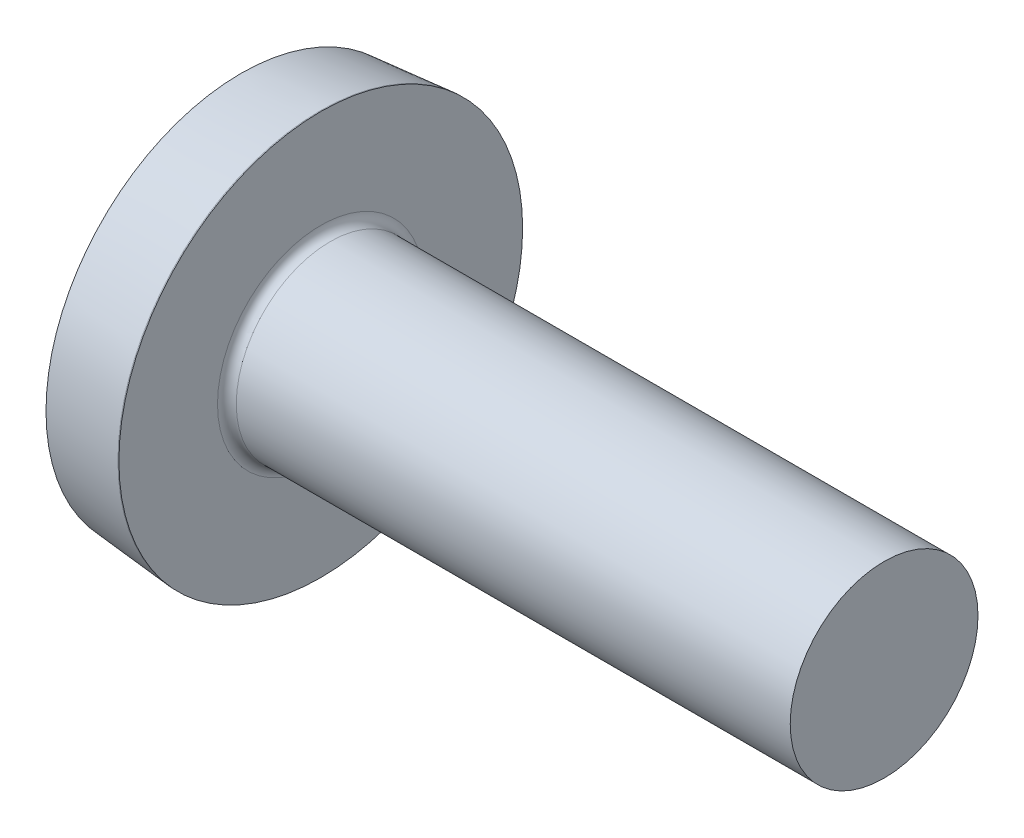
ISO-10303-21;
HEADER;
FILE_DESCRIPTION(('STEP AP214'),'2;1');
FILE_NAME('part.step','',(''),(''),'','','');
FILE_SCHEMA(('AUTOMOTIVE_DESIGN { 1 0 10303 214 1 1 1 1 }'));
ENDSEC;
DATA;
#1=APPLICATION_CONTEXT('core data for automotive mechanical design processes');
#2=APPLICATION_PROTOCOL_DEFINITION('international standard','automotive_design',2000,#1);
#3=PRODUCT_CONTEXT('',#1,'mechanical');
#4=PRODUCT('Part','Part','',(#3));
#5=PRODUCT_RELATED_PRODUCT_CATEGORY('part','',(#4));
#6=PRODUCT_DEFINITION_FORMATION('','',#4);
#7=PRODUCT_DEFINITION_CONTEXT('part definition',#1,'design');
#8=PRODUCT_DEFINITION('design','',#6,#7);
#9=PRODUCT_DEFINITION_SHAPE('','',#8);
#10=(LENGTH_UNIT() NAMED_UNIT(*) SI_UNIT(.MILLI.,.METRE.));
#11=(NAMED_UNIT(*) PLANE_ANGLE_UNIT() SI_UNIT($,.RADIAN.));
#12=(NAMED_UNIT(*) SI_UNIT($,.STERADIAN.) SOLID_ANGLE_UNIT());
#13=UNCERTAINTY_MEASURE_WITH_UNIT(LENGTH_MEASURE(1.E-05),#10,'distance_accuracy_value','');
#14=(GEOMETRIC_REPRESENTATION_CONTEXT(3) GLOBAL_UNCERTAINTY_ASSIGNED_CONTEXT((#13)) GLOBAL_UNIT_ASSIGNED_CONTEXT((#10,
#11,#12)) REPRESENTATION_CONTEXT('',''));
#15=CARTESIAN_POINT('',(0.,0.,0.));
#16=DIRECTION('',(0.,0.,1.));
#17=DIRECTION('',(1.,0.,0.));
#18=AXIS2_PLACEMENT_3D('',#15,#16,#17);
#19=CARTESIAN_POINT('',(6.3348454251532,0.,0.));
#20=DIRECTION('',(-1.,0.,0.));
#21=DIRECTION('',(0.,1.,0.));
#22=AXIS2_PLACEMENT_3D('',#19,#20,#21);
#23=SPHERICAL_SURFACE('',#22,6.3348454251532);
#24=CARTESIAN_POINT('',(0.35,0.,0.));
#25=DIRECTION('',(-1.,0.,0.));
#26=DIRECTION('',(0.,0.,1.));
#27=AXIS2_PLACEMENT_3D('',#24,#25,#26);
#28=CIRCLE('',#27,2.07650952263822);
#29=CARTESIAN_POINT('',(0.35,0.,2.07650952263822));
#30=VERTEX_POINT('',#29);
#31=EDGE_CURVE('E212',#30,#30,#28,.T.);
#32=ORIENTED_EDGE('',*,*,#31,.T.);
#33=EDGE_LOOP('',(#32));
#34=FACE_BOUND('',#33,.T.);
#35=CARTESIAN_POINT('',(0.0308541818001143,0.,0.));
#36=DIRECTION('',(1.,0.,0.));
#37=DIRECTION('',(0.,0.,-1.));
#38=AXIS2_PLACEMENT_3D('',#35,#36,#37);
#39=CIRCLE('',#38,0.624468545494531);
#40=CARTESIAN_POINT('',(0.0308541818001147,-0.369999999999998,-0.503051651733752));
#41=VERTEX_POINT('',#40);
#42=CARTESIAN_POINT('',(0.0308541818001148,-0.503051651733748,-0.37));
#43=VERTEX_POINT('',#42);
#44=EDGE_CURVE('E338',#41,#43,#39,.F.);
#45=ORIENTED_EDGE('',*,*,#44,.F.);
#46=CARTESIAN_POINT('',(6.3348454251532,-0.370000000000002,0.));
#47=DIRECTION('',(0.,1.,0.));
#48=DIRECTION('',(0.,0.,1.));
#49=AXIS2_PLACEMENT_3D('',#46,#47,#48);
#50=CIRCLE('',#49,6.32403087916121);
#51=CARTESIAN_POINT('',(0.0987223988869555,-0.369999999999996,-1.05077883584338));
#52=VERTEX_POINT('',#51);
#53=EDGE_CURVE('E272',#52,#41,#50,.T.);
#54=ORIENTED_EDGE('',*,*,#53,.F.);
#55=CARTESIAN_POINT('',(5.51287510984501,0.,1.64861767760881));
#56=DIRECTION('',(0.446197753347436,0.,-0.894934391398443));
#57=DIRECTION('',(-0.894934391398442,0.,-0.446197753347436));
#58=AXIS2_PLACEMENT_3D('',#55,#56,#57);
#59=CIRCLE('',#58,6.06108002870877);
#60=CARTESIAN_POINT('',(0.0987223988869555,0.370000000000004,-1.05077883584338));
#61=VERTEX_POINT('',#60);
#62=EDGE_CURVE('E246',#52,#61,#59,.T.);
#63=ORIENTED_EDGE('',*,*,#62,.T.);
#64=CARTESIAN_POINT('',(6.3348454251532,0.37,0.));
#65=DIRECTION('',(0.,-1.,0.));
#66=DIRECTION('',(0.,0.,-1.));
#67=AXIS2_PLACEMENT_3D('',#64,#65,#66);
#68=CIRCLE('',#67,6.32403087916121);
#69=CARTESIAN_POINT('',(0.0308541818001145,0.370000000000002,-0.503051651733749));
#70=VERTEX_POINT('',#69);
#71=EDGE_CURVE('E300',#70,#61,#68,.T.);
#72=ORIENTED_EDGE('',*,*,#71,.F.);
#73=CARTESIAN_POINT('',(0.0308541818001148,0.50305165173374,-0.37));
#74=VERTEX_POINT('',#73);
#75=EDGE_CURVE('E353',#74,#70,#39,.F.);
#76=ORIENTED_EDGE('',*,*,#75,.F.);
#77=CARTESIAN_POINT('',(6.3348454251532,0.,-0.37));
#78=DIRECTION('',(0.,0.,1.));
#79=DIRECTION('',(0.,-1.,0.));
#80=AXIS2_PLACEMENT_3D('',#77,#78,#79);
#81=CIRCLE('',#80,6.32403087916121);
#82=CARTESIAN_POINT('',(0.0987223988869555,1.05077883584338,-0.37));
#83=VERTEX_POINT('',#82);
#84=EDGE_CURVE('E240',#83,#74,#81,.T.);
#85=ORIENTED_EDGE('',*,*,#84,.F.);
#86=CARTESIAN_POINT('',(5.51287510984501,-1.64861767760882,0.));
#87=DIRECTION('',(0.446197753347436,0.894934391398442,0.));
#88=DIRECTION('',(-0.894934391398442,0.446197753347436,0.));
#89=AXIS2_PLACEMENT_3D('',#86,#87,#88);
#90=CIRCLE('',#89,6.06108002870877);
#91=CARTESIAN_POINT('',(0.0987223988869555,1.05077883584338,0.37));
#92=VERTEX_POINT('',#91);
#93=EDGE_CURVE('E243',#83,#92,#90,.T.);
#94=ORIENTED_EDGE('',*,*,#93,.T.);
#95=CARTESIAN_POINT('',(6.3348454251532,0.,0.370000000000002));
#96=DIRECTION('',(0.,0.,-1.));
#97=DIRECTION('',(-1.,0.,0.));
#98=AXIS2_PLACEMENT_3D('',#95,#96,#97);
#99=CIRCLE('',#98,6.32403087916121);
#100=CARTESIAN_POINT('',(0.0308541818001143,0.503051651733743,0.369999999999999));
#101=VERTEX_POINT('',#100);
#102=EDGE_CURVE('E236',#101,#92,#99,.T.);
#103=ORIENTED_EDGE('',*,*,#102,.F.);
#104=CARTESIAN_POINT('',(0.0308541818001154,0.369999999999998,0.503051651733752));
#105=VERTEX_POINT('',#104);
#106=EDGE_CURVE('E352',#105,#101,#39,.F.);
#107=ORIENTED_EDGE('',*,*,#106,.F.);
#108=CARTESIAN_POINT('',(0.0987223988869546,0.369999999999996,1.05077883584338));
#109=VERTEX_POINT('',#108);
#110=EDGE_CURVE('E256',#109,#105,#68,.T.);
#111=ORIENTED_EDGE('',*,*,#110,.F.);
#112=CARTESIAN_POINT('',(5.51287510984501,0.,-1.64861767760882));
#113=DIRECTION('',(0.446197753347436,0.,0.894934391398442));
#114=DIRECTION('',(0.894934391398442,0.,-0.446197753347436));
#115=AXIS2_PLACEMENT_3D('',#112,#113,#114);
#116=CIRCLE('',#115,6.06108002870877);
#117=CARTESIAN_POINT('',(0.0987223988869546,-0.370000000000004,1.05077883584338));
#118=VERTEX_POINT('',#117);
#119=EDGE_CURVE('E47',#109,#118,#116,.T.);
#120=ORIENTED_EDGE('',*,*,#119,.T.);
#121=CARTESIAN_POINT('',(0.0308541818001156,-0.370000000000001,0.50305165173375));
#122=VERTEX_POINT('',#121);
#123=EDGE_CURVE('E253',#122,#118,#50,.T.);
#124=ORIENTED_EDGE('',*,*,#123,.F.);
#125=CARTESIAN_POINT('',(0.0308541818001143,-0.503051651733752,0.369999999999999));
#126=VERTEX_POINT('',#125);
#127=EDGE_CURVE('E384',#126,#122,#39,.F.);
#128=ORIENTED_EDGE('',*,*,#127,.F.);
#129=CARTESIAN_POINT('',(0.0987223988869555,-1.05077883584338,0.369999999999999));
#130=VERTEX_POINT('',#129);
#131=EDGE_CURVE('E237',#130,#126,#99,.T.);
#132=ORIENTED_EDGE('',*,*,#131,.F.);
#133=CARTESIAN_POINT('',(5.51287510984501,1.64861767760881,0.));
#134=DIRECTION('',(0.446197753347436,-0.894934391398443,0.));
#135=DIRECTION('',(0.894934391398442,0.446197753347436,0.));
#136=AXIS2_PLACEMENT_3D('',#133,#134,#135);
#137=CIRCLE('',#136,6.06108002870877);
#138=CARTESIAN_POINT('',(0.0987223988869555,-1.05077883584338,-0.37));
#139=VERTEX_POINT('',#138);
#140=EDGE_CURVE('E233',#130,#139,#137,.T.);
#141=ORIENTED_EDGE('',*,*,#140,.T.);
#142=EDGE_CURVE('E62',#43,#139,#81,.T.);
#143=ORIENTED_EDGE('',*,*,#142,.F.);
#144=EDGE_LOOP('',(#45,#54,#63,#72,#76,#85,#94,#103,#107,#111,#120,#124,#128,#132,#141,#143));
#145=FACE_BOUND('',#144,.T.);
#146=ADVANCED_FACE('F34',(#34,#145),#23,.T.);
#147=CARTESIAN_POINT('',(1.01,0.596432660078354,-0.37));
#148=DIRECTION('',(0.,0.,1.));
#149=DIRECTION('',(0.,-1.,0.));
#150=AXIS2_PLACEMENT_3D('',#147,#148,#149);
#151=PLANE('',#150);
#152=ORIENTED_EDGE('',*,*,#84,.T.);
#153=CARTESIAN_POINT('',(-1.00375424089343,0.59046737533365,-0.37));
#154=CARTESIAN_POINT('',(-0.812310935860284,0.574661113876544,-0.37));
#155=CARTESIAN_POINT('',(-0.620880739529457,0.558692671237369,-0.37));
#156=CARTESIAN_POINT('',(-0.238044908616173,0.526292999478973,-0.37));
#157=CARTESIAN_POINT('',(-0.0466392770084405,0.50986173526022,-0.37));
#158=CARTESIAN_POINT('',(0.336119298740636,0.476400416240064,-0.37));
#159=CARTESIAN_POINT('',(0.52747224306179,0.459370363508376,-0.37));
#160=CARTESIAN_POINT('',(0.814438066922587,0.433198294596456,-0.37));
#161=CARTESIAN_POINT('',(0.910079559074602,0.424370077730999,-0.37));
#162=CARTESIAN_POINT('',(1.10134094999858,0.406460000314888,-0.37));
#163=CARTESIAN_POINT('',(1.19696084824844,0.397378134180927,-0.37));
#164=CARTESIAN_POINT('',(1.45340398862988,0.372604820081678,-0.37));
#165=CARTESIAN_POINT('',(1.61420013682287,0.356631661992527,-0.37));
#166=CARTESIAN_POINT('',(1.93565257091465,0.323419643215244,-0.37));
#167=CARTESIAN_POINT('',(2.09630886589015,0.306180872007446,-0.37));
#168=CARTESIAN_POINT('',(2.33714482323072,0.278751725007018,-0.37));
#169=CARTESIAN_POINT('',(2.41741328301872,0.269344994364363,-0.37));
#170=CARTESIAN_POINT('',(2.57785878610541,0.249811311041056,-0.37));
#171=CARTESIAN_POINT('',(2.65803583391149,0.239684395583776,-0.37));
#172=CARTESIAN_POINT('',(2.8182787310521,0.218399805516524,-0.37));
#173=CARTESIAN_POINT('',(2.89834454264389,0.207241840980378,-0.37));
#174=CARTESIAN_POINT('',(3.01826768351679,0.189275113325608,-0.37));
#175=CARTESIAN_POINT('',(3.05821623214618,0.183080654485872,-0.37));
#176=CARTESIAN_POINT('',(3.13802273653468,0.17011763897259,-0.37));
#177=CARTESIAN_POINT('',(3.17788068529328,0.16334903938742,-0.37));
#178=CARTESIAN_POINT('',(3.21767546600845,0.156211627647228,-0.37));
#179=B_SPLINE_CURVE_WITH_KNOTS('',3,(#153,#154,#155,#156,#157,#158,#159,#160,#161,#162,#163,
#164,#165,#166,#167,#168,#169,#170,#171,#172,#173,#174,#175,#176,#177,#178),.UNSPECIFIED.,.F.,
.F.,(4,2,2,2,2,2,2,2,2,2,2,2,4),(0.,0.576284452128467,1.15261272690249,1.72893900979114,
2.01708296211952,2.3052332620563,2.78999332133071,3.27471914044355,3.51717007338411,
3.75960848413396,4.00211527609772,4.123389551722,4.24467289945864),.UNSPECIFIED.);
#180=CARTESIAN_POINT('',(1.01,0.415013252800438,-0.369999999999999));
#181=VERTEX_POINT('',#180);
#182=EDGE_CURVE('E373',#74,#181,#179,.T.);
#183=ORIENTED_EDGE('',*,*,#182,.T.);
#184=DIRECTION('',(0.,1.,0.));
#185=VECTOR('',#184,1.);
#186=CARTESIAN_POINT('',(1.01,-0.596432660078355,-0.37));
#187=LINE('',#186,#185);
#188=CARTESIAN_POINT('',(1.01,0.596432660078354,-0.37));
#189=VERTEX_POINT('',#188);
#190=EDGE_CURVE('E321',#181,#189,#187,.T.);
#191=ORIENTED_EDGE('',*,*,#190,.T.);
#192=DIRECTION('',(0.894934391398442,-0.446197753347436,0.));
#193=VECTOR('',#192,1.);
#194=CARTESIAN_POINT('',(0.,1.1,-0.37));
#195=LINE('',#194,#193);
#196=EDGE_CURVE('E213',#83,#189,#195,.T.);
#197=ORIENTED_EDGE('',*,*,#196,.F.);
#198=EDGE_LOOP('',(#152,#183,#191,#197));
#199=FACE_BOUND('',#198,.T.);
#200=ADVANCED_FACE('F168',(#199),#151,.T.);
#201=CARTESIAN_POINT('',(1.01,-0.596432660078355,-0.37));
#202=VERTEX_POINT('',#201);
#203=CARTESIAN_POINT('',(1.01,-0.415013252800438,-0.369999999999999));
#204=VERTEX_POINT('',#203);
#205=EDGE_CURVE('E221',#202,#204,#187,.T.);
#206=ORIENTED_EDGE('',*,*,#205,.T.);
#207=CARTESIAN_POINT('',(-1.00375424089343,-0.59046737533365,-0.37));
#208=CARTESIAN_POINT('',(-0.812310935860285,-0.574661113876544,-0.37));
#209=CARTESIAN_POINT('',(-0.620880739529458,-0.558692671237369,-0.37));
#210=CARTESIAN_POINT('',(-0.238044908616174,-0.526292999478973,-0.37));
#211=CARTESIAN_POINT('',(-0.0466392770084411,-0.50986173526022,-0.37));
#212=CARTESIAN_POINT('',(0.336119298740635,-0.476400416240064,-0.37));
#213=CARTESIAN_POINT('',(0.527472243061789,-0.459370363508376,-0.37));
#214=CARTESIAN_POINT('',(0.814438066922586,-0.433198294596456,-0.37));
#215=CARTESIAN_POINT('',(0.910079559074601,-0.424370077730999,-0.37));
#216=CARTESIAN_POINT('',(1.10134094999858,-0.406460000314888,-0.37));
#217=CARTESIAN_POINT('',(1.19696084824844,-0.397378134180927,-0.37));
#218=CARTESIAN_POINT('',(1.45340398862988,-0.372604820081678,-0.37));
#219=CARTESIAN_POINT('',(1.61420013682287,-0.356631661992527,-0.37));
#220=CARTESIAN_POINT('',(1.93565257091465,-0.323419643215243,-0.37));
#221=CARTESIAN_POINT('',(2.09630886589015,-0.306180872007446,-0.37));
#222=CARTESIAN_POINT('',(2.33714482323072,-0.278751725007017,-0.37));
#223=CARTESIAN_POINT('',(2.41741328301872,-0.269344994364363,-0.37));
#224=CARTESIAN_POINT('',(2.57785878610541,-0.249811311041056,-0.37));
#225=CARTESIAN_POINT('',(2.6580358339115,-0.239684395583775,-0.37));
#226=CARTESIAN_POINT('',(2.81827873105211,-0.218399805516523,-0.37));
#227=CARTESIAN_POINT('',(2.8983445426439,-0.207241840980377,-0.37));
#228=CARTESIAN_POINT('',(3.01826768351679,-0.189275113325608,-0.37));
#229=CARTESIAN_POINT('',(3.05821623214619,-0.183080654485871,-0.37));
#230=CARTESIAN_POINT('',(3.13802273653468,-0.170117638972589,-0.37));
#231=CARTESIAN_POINT('',(3.17788068529328,-0.16334903938742,-0.37));
#232=CARTESIAN_POINT('',(3.21767546600845,-0.156211627647227,-0.37));
#233=B_SPLINE_CURVE_WITH_KNOTS('',3,(#207,#208,#209,#210,#211,#212,#213,#214,#215,#216,#217,
#218,#219,#220,#221,#222,#223,#224,#225,#226,#227,#228,#229,#230,#231,#232),.UNSPECIFIED.,.F.,
.F.,(4,2,2,2,2,2,2,2,2,2,2,2,4),(0.,0.576284452128467,1.15261272690249,1.72893900979114,
2.01708296211952,2.3052332620563,2.78999332133071,3.27471914044355,3.51717007338411,
3.75960848413396,4.00211527609772,4.123389551722,4.24467289945864),.UNSPECIFIED.);
#234=EDGE_CURVE('E351',#204,#43,#233,.F.);
#235=ORIENTED_EDGE('',*,*,#234,.T.);
#236=ORIENTED_EDGE('',*,*,#142,.T.);
#237=DIRECTION('',(0.894934391398442,0.446197753347436,0.));
#238=VECTOR('',#237,1.);
#239=CARTESIAN_POINT('',(0.,-1.1,-0.37));
#240=LINE('',#239,#238);
#241=EDGE_CURVE('E303',#139,#202,#240,.T.);
#242=ORIENTED_EDGE('',*,*,#241,.T.);
#243=EDGE_LOOP('',(#206,#235,#236,#242));
#244=FACE_BOUND('',#243,.T.);
#245=ADVANCED_FACE('F174',(#244),#151,.T.);
#246=CARTESIAN_POINT('',(1.01,-0.596432660078355,0.37));
#247=DIRECTION('',(0.,0.,-1.));
#248=DIRECTION('',(-1.,0.,0.));
#249=AXIS2_PLACEMENT_3D('',#246,#247,#248);
#250=PLANE('',#249);
#251=DIRECTION('',(0.,-1.,0.));
#252=VECTOR('',#251,1.);
#253=CARTESIAN_POINT('',(1.01,0.596432660078354,0.37));
#254=LINE('',#253,#252);
#255=CARTESIAN_POINT('',(1.01,0.596432660078354,0.37));
#256=VERTEX_POINT('',#255);
#257=CARTESIAN_POINT('',(1.01,0.415013252800438,0.369999999999999));
#258=VERTEX_POINT('',#257);
#259=EDGE_CURVE('E311',#256,#258,#254,.T.);
#260=ORIENTED_EDGE('',*,*,#259,.T.);
#261=CARTESIAN_POINT('',(-1.00375424089236,0.590467375333562,0.369999999999999));
#262=CARTESIAN_POINT('',(-0.81231093585923,0.574661113876457,0.369999999999999));
#263=CARTESIAN_POINT('',(-0.620880739528422,0.558692671237283,0.369999999999999));
#264=CARTESIAN_POINT('',(-0.238044908615175,0.526292999478888,0.369999999999999));
#265=CARTESIAN_POINT('',(-0.0466392770074608,0.509861735260135,0.37));
#266=CARTESIAN_POINT('',(0.336119298741582,0.47640041623998,0.37));
#267=CARTESIAN_POINT('',(0.527472243062721,0.459370363508292,0.37));
#268=CARTESIAN_POINT('',(0.814438066923495,0.433198294596373,0.37));
#269=CARTESIAN_POINT('',(0.910079559075503,0.424370077730915,0.37));
#270=CARTESIAN_POINT('',(1.10134094999946,0.406460000314804,0.37));
#271=CARTESIAN_POINT('',(1.19696084824931,0.397378134180843,0.37));
#272=CARTESIAN_POINT('',(1.45340398863075,0.372604820081592,0.37));
#273=CARTESIAN_POINT('',(1.61420013682374,0.356631661992439,0.37));
#274=CARTESIAN_POINT('',(1.93565257091552,0.323419643215151,0.37));
#275=CARTESIAN_POINT('',(2.09630886589102,0.306180872007351,0.37));
#276=CARTESIAN_POINT('',(2.33714482323159,0.278751725006916,0.37));
#277=CARTESIAN_POINT('',(2.41741328301959,0.269344994364259,0.37));
#278=CARTESIAN_POINT('',(2.57785878610628,0.249811311040946,0.37));
#279=CARTESIAN_POINT('',(2.65803583391236,0.239684395583663,0.370000000000001));
#280=CARTESIAN_POINT('',(2.81827873105297,0.218399805516403,0.370000000000001));
#281=CARTESIAN_POINT('',(2.89834454264476,0.207241840980253,0.370000000000001));
#282=CARTESIAN_POINT('',(3.01826768351766,0.189275113325474,0.370000000000001));
#283=CARTESIAN_POINT('',(3.05821623214705,0.183080654485734,0.370000000000001));
#284=CARTESIAN_POINT('',(3.13802273653554,0.170117638972443,0.370000000000001));
#285=CARTESIAN_POINT('',(3.17788068529415,0.163349039387269,0.370000000000001));
#286=CARTESIAN_POINT('',(3.21767546600931,0.15621162764707,0.370000000000001));
#287=B_SPLINE_CURVE_WITH_KNOTS('',3,(#261,#262,#263,#264,#265,#266,#267,#268,#269,#270,#271,
#272,#273,#274,#275,#276,#277,#278,#279,#280,#281,#282,#283,#284,#285,#286),.UNSPECIFIED.,.F.,
.F.,(4,2,2,2,2,2,2,2,2,2,2,2,4),(0.,0.576284452128412,1.15261272690238,1.72893900979099,
2.01708296211935,2.3052332620561,2.78999332133051,3.27471914044335,3.51717007338391,
3.75960848413376,4.00211527609752,4.1233895517218,4.24467289945844),.UNSPECIFIED.);
#288=EDGE_CURVE('E277',#258,#101,#287,.F.);
#289=ORIENTED_EDGE('',*,*,#288,.T.);
#290=ORIENTED_EDGE('',*,*,#102,.T.);
#291=DIRECTION('',(0.894934391398442,-0.446197753347436,0.));
#292=VECTOR('',#291,1.);
#293=CARTESIAN_POINT('',(0.,1.1,0.37));
#294=LINE('',#293,#292);
#295=EDGE_CURVE('E218',#92,#256,#294,.T.);
#296=ORIENTED_EDGE('',*,*,#295,.T.);
#297=EDGE_LOOP('',(#260,#289,#290,#296));
#298=FACE_BOUND('',#297,.T.);
#299=ADVANCED_FACE('F369',(#298),#250,.T.);
#300=ORIENTED_EDGE('',*,*,#131,.T.);
#301=CARTESIAN_POINT('',(-1.00375424089236,-0.590467375333562,0.369999999999999));
#302=CARTESIAN_POINT('',(-0.81231093585923,-0.574661113876457,0.369999999999999));
#303=CARTESIAN_POINT('',(-0.620880739528422,-0.558692671237283,0.369999999999999));
#304=CARTESIAN_POINT('',(-0.238044908615175,-0.526292999478888,0.369999999999999));
#305=CARTESIAN_POINT('',(-0.0466392770074607,-0.509861735260136,0.369999999999999));
#306=CARTESIAN_POINT('',(0.336119298741582,-0.47640041623998,0.37));
#307=CARTESIAN_POINT('',(0.52747224306272,-0.459370363508292,0.37));
#308=CARTESIAN_POINT('',(0.814438066923495,-0.433198294596373,0.37));
#309=CARTESIAN_POINT('',(0.910079559075503,-0.424370077730915,0.37));
#310=CARTESIAN_POINT('',(1.10134094999946,-0.406460000314804,0.37));
#311=CARTESIAN_POINT('',(1.19696084824931,-0.397378134180843,0.37));
#312=CARTESIAN_POINT('',(1.45340398863075,-0.372604820081592,0.37));
#313=CARTESIAN_POINT('',(1.61420013682374,-0.356631661992439,0.37));
#314=CARTESIAN_POINT('',(1.93565257091552,-0.323419643215151,0.37));
#315=CARTESIAN_POINT('',(2.09630886589102,-0.306180872007351,0.37));
#316=CARTESIAN_POINT('',(2.33714482323159,-0.278751725006916,0.37));
#317=CARTESIAN_POINT('',(2.41741328301959,-0.269344994364259,0.37));
#318=CARTESIAN_POINT('',(2.57785878610628,-0.249811311040947,0.37));
#319=CARTESIAN_POINT('',(2.65803583391236,-0.239684395583663,0.370000000000001));
#320=CARTESIAN_POINT('',(2.81827873105297,-0.218399805516403,0.370000000000001));
#321=CARTESIAN_POINT('',(2.89834454264476,-0.207241840980253,0.370000000000001));
#322=CARTESIAN_POINT('',(3.01826768351765,-0.189275113325474,0.370000000000001));
#323=CARTESIAN_POINT('',(3.05821623214705,-0.183080654485734,0.370000000000001));
#324=CARTESIAN_POINT('',(3.13802273653554,-0.170117638972444,0.370000000000001));
#325=CARTESIAN_POINT('',(3.17788068529414,-0.163349039387269,0.370000000000001));
#326=CARTESIAN_POINT('',(3.21767546600931,-0.15621162764707,0.370000000000001));
#327=B_SPLINE_CURVE_WITH_KNOTS('',3,(#301,#302,#303,#304,#305,#306,#307,#308,#309,#310,#311,
#312,#313,#314,#315,#316,#317,#318,#319,#320,#321,#322,#323,#324,#325,#326),.UNSPECIFIED.,.F.,
.F.,(4,2,2,2,2,2,2,2,2,2,2,2,4),(0.,0.576284452128412,1.15261272690238,1.72893900979099,
2.01708296211935,2.3052332620561,2.78999332133051,3.27471914044335,3.51717007338391,
3.75960848413376,4.00211527609752,4.1233895517218,4.24467289945844),.UNSPECIFIED.);
#328=CARTESIAN_POINT('',(1.01,-0.415013252800438,0.369999999999999));
#329=VERTEX_POINT('',#328);
#330=EDGE_CURVE('E385',#126,#329,#327,.T.);
#331=ORIENTED_EDGE('',*,*,#330,.T.);
#332=CARTESIAN_POINT('',(1.01,-0.596432660078355,0.37));
#333=VERTEX_POINT('',#332);
#334=EDGE_CURVE('E313',#329,#333,#254,.T.);
#335=ORIENTED_EDGE('',*,*,#334,.T.);
#336=DIRECTION('',(0.894934391398442,0.446197753347436,0.));
#337=VECTOR('',#336,1.);
#338=CARTESIAN_POINT('',(0.,-1.1,0.369999999999999));
#339=LINE('',#338,#337);
#340=EDGE_CURVE('E305',#130,#333,#339,.T.);
#341=ORIENTED_EDGE('',*,*,#340,.F.);
#342=EDGE_LOOP('',(#300,#331,#335,#341));
#343=FACE_BOUND('',#342,.T.);
#344=ADVANCED_FACE('F414',(#343),#250,.T.);
#345=CARTESIAN_POINT('',(1.01,0.596432660078354,-0.37));
#346=DIRECTION('',(-1.,0.,0.));
#347=DIRECTION('',(0.,0.,1.));
#348=AXIS2_PLACEMENT_3D('',#345,#346,#347);
#349=PLANE('',#348);
#350=ORIENTED_EDGE('',*,*,#334,.F.);
#351=CARTESIAN_POINT('',(1.01,0.,0.));
#352=DIRECTION('',(-1.,0.,0.));
#353=DIRECTION('',(0.,0.,1.));
#354=AXIS2_PLACEMENT_3D('',#351,#352,#353);
#355=CIRCLE('',#354,0.556);
#356=EDGE_CURVE('E346',#204,#329,#355,.T.);
#357=ORIENTED_EDGE('',*,*,#356,.F.);
#358=ORIENTED_EDGE('',*,*,#205,.F.);
#359=DIRECTION('',(0.,0.,1.));
#360=VECTOR('',#359,1.);
#361=CARTESIAN_POINT('',(1.01,-0.596432660078355,-0.37));
#362=LINE('',#361,#360);
#363=EDGE_CURVE('E308',#202,#333,#362,.T.);
#364=ORIENTED_EDGE('',*,*,#363,.T.);
#365=EDGE_LOOP('',(#350,#357,#358,#364));
#366=FACE_BOUND('',#365,.T.);
#367=ADVANCED_FACE('F407',(#366),#349,.T.);
#368=DIRECTION('',(0.,0.,-1.));
#369=VECTOR('',#368,1.);
#370=CARTESIAN_POINT('',(1.01,-0.370000000000002,0.596432660078353));
#371=LINE('',#370,#369);
#372=CARTESIAN_POINT('',(1.01,-0.369999999999998,-0.415013252800441));
#373=VERTEX_POINT('',#372);
#374=CARTESIAN_POINT('',(1.01,-0.369999999999998,-0.596432660078356));
#375=VERTEX_POINT('',#374);
#376=EDGE_CURVE('E294',#373,#375,#371,.T.);
#377=ORIENTED_EDGE('',*,*,#376,.F.);
#378=CARTESIAN_POINT('',(1.01,0.370000000000001,-0.415013252800436));
#379=VERTEX_POINT('',#378);
#380=EDGE_CURVE('E54',#379,#373,#355,.T.);
#381=ORIENTED_EDGE('',*,*,#380,.F.);
#382=DIRECTION('',(0.,0.,1.));
#383=VECTOR('',#382,1.);
#384=CARTESIAN_POINT('',(1.01,0.370000000000002,-0.596432660078354));
#385=LINE('',#384,#383);
#386=CARTESIAN_POINT('',(1.01,0.370000000000002,-0.596432660078354));
#387=VERTEX_POINT('',#386);
#388=EDGE_CURVE('E297',#387,#379,#385,.T.);
#389=ORIENTED_EDGE('',*,*,#388,.F.);
#390=DIRECTION('',(0.,-1.,0.));
#391=VECTOR('',#390,1.);
#392=CARTESIAN_POINT('',(1.01,0.370000000000002,-0.596432660078354));
#393=LINE('',#392,#391);
#394=EDGE_CURVE('E288',#387,#375,#393,.T.);
#395=ORIENTED_EDGE('',*,*,#394,.T.);
#396=EDGE_LOOP('',(#377,#381,#389,#395));
#397=FACE_BOUND('',#396,.T.);
#398=ADVANCED_FACE('F341',(#397),#349,.T.);
#399=ORIENTED_EDGE('',*,*,#190,.F.);
#400=EDGE_CURVE('E345',#258,#181,#355,.T.);
#401=ORIENTED_EDGE('',*,*,#400,.F.);
#402=ORIENTED_EDGE('',*,*,#259,.F.);
#403=DIRECTION('',(0.,0.,-1.));
#404=VECTOR('',#403,1.);
#405=CARTESIAN_POINT('',(1.01,0.596432660078354,0.37));
#406=LINE('',#405,#404);
#407=EDGE_CURVE('E314',#256,#189,#406,.T.);
#408=ORIENTED_EDGE('',*,*,#407,.T.);
#409=EDGE_LOOP('',(#399,#401,#402,#408));
#410=FACE_BOUND('',#409,.T.);
#411=ADVANCED_FACE('F408',(#410),#349,.T.);
#412=CARTESIAN_POINT('',(1.01,0.369999999999998,0.596432660078356));
#413=DIRECTION('',(0.,-1.,0.));
#414=DIRECTION('',(0.,0.,-1.));
#415=AXIS2_PLACEMENT_3D('',#412,#413,#414);
#416=PLANE('',#415);
#417=ORIENTED_EDGE('',*,*,#110,.T.);
#418=CARTESIAN_POINT('',(-1.00375424089343,0.369999999999998,0.590467375333651));
#419=CARTESIAN_POINT('',(-0.812310935860284,0.369999999999998,0.574661113876545));
#420=CARTESIAN_POINT('',(-0.620880739529457,0.369999999999998,0.558692671237371));
#421=CARTESIAN_POINT('',(-0.238044908616173,0.369999999999998,0.526292999478974));
#422=CARTESIAN_POINT('',(-0.0466392770084403,0.369999999999998,0.509861735260221));
#423=CARTESIAN_POINT('',(0.336119298740636,0.369999999999998,0.476400416240065));
#424=CARTESIAN_POINT('',(0.52747224306179,0.369999999999998,0.459370363508377));
#425=CARTESIAN_POINT('',(0.814438066922587,0.369999999999998,0.433198294596458));
#426=CARTESIAN_POINT('',(0.910079559074602,0.369999999999998,0.424370077731));
#427=CARTESIAN_POINT('',(1.10134094999858,0.369999999999999,0.406460000314889));
#428=CARTESIAN_POINT('',(1.19696084824844,0.369999999999999,0.397378134180928));
#429=CARTESIAN_POINT('',(1.45340398862988,0.369999999999999,0.372604820081679));
#430=CARTESIAN_POINT('',(1.61420013682287,0.369999999999999,0.356631661992528));
#431=CARTESIAN_POINT('',(1.93565257091465,0.369999999999999,0.323419643215245));
#432=CARTESIAN_POINT('',(2.09630886589015,0.369999999999999,0.306180872007448));
#433=CARTESIAN_POINT('',(2.33714482323072,0.369999999999999,0.278751725007019));
#434=CARTESIAN_POINT('',(2.41741328301872,0.369999999999999,0.269344994364365));
#435=CARTESIAN_POINT('',(2.57785878610541,0.369999999999999,0.249811311041057));
#436=CARTESIAN_POINT('',(2.65803583391149,0.369999999999999,0.239684395583777));
#437=CARTESIAN_POINT('',(2.8182787310521,0.369999999999999,0.218399805516525));
#438=CARTESIAN_POINT('',(2.8983445426439,0.369999999999999,0.207241840980379));
#439=CARTESIAN_POINT('',(3.01826768351679,0.369999999999999,0.189275113325609));
#440=CARTESIAN_POINT('',(3.05821623214618,0.369999999999999,0.183080654485873));
#441=CARTESIAN_POINT('',(3.13802273653468,0.369999999999999,0.170117638972591));
#442=CARTESIAN_POINT('',(3.17788068529328,0.369999999999999,0.163349039387421));
#443=CARTESIAN_POINT('',(3.21767546600845,0.369999999999999,0.156211627647229));
#444=B_SPLINE_CURVE_WITH_KNOTS('',3,(#418,#419,#420,#421,#422,#423,#424,#425,#426,#427,#428,
#429,#430,#431,#432,#433,#434,#435,#436,#437,#438,#439,#440,#441,#442,#443),.UNSPECIFIED.,.F.,
.F.,(4,2,2,2,2,2,2,2,2,2,2,2,4),(0.,0.576284452128467,1.15261272690249,1.72893900979114,
2.01708296211952,2.3052332620563,2.78999332133071,3.27471914044355,3.51717007338411,
3.75960848413396,4.00211527609772,4.123389551722,4.24467289945864),.UNSPECIFIED.);
#445=CARTESIAN_POINT('',(1.01,0.369999999999998,0.415013252800439));
#446=VERTEX_POINT('',#445);
#447=EDGE_CURVE('E432',#105,#446,#444,.T.);
#448=ORIENTED_EDGE('',*,*,#447,.T.);
#449=CARTESIAN_POINT('',(1.01,0.369999999999998,0.596432660078356));
#450=VERTEX_POINT('',#449);
#451=EDGE_CURVE('E270',#446,#450,#385,.T.);
#452=ORIENTED_EDGE('',*,*,#451,.T.);
#453=DIRECTION('',(0.894934391398442,0.,-0.446197753347436));
#454=VECTOR('',#453,1.);
#455=CARTESIAN_POINT('',(0.,0.369999999999996,1.1));
#456=LINE('',#455,#454);
#457=EDGE_CURVE('E263',#109,#450,#456,.T.);
#458=ORIENTED_EDGE('',*,*,#457,.F.);
#459=EDGE_LOOP('',(#417,#448,#452,#458));
#460=FACE_BOUND('',#459,.T.);
#461=ADVANCED_FACE('F267',(#460),#416,.T.);
#462=CARTESIAN_POINT('',(1.01,-0.369999999999998,-0.596432660078356));
#463=DIRECTION('',(0.,1.,0.));
#464=DIRECTION('',(-1.,0.,0.));
#465=AXIS2_PLACEMENT_3D('',#462,#463,#464);
#466=PLANE('',#465);
#467=CARTESIAN_POINT('',(1.01,-0.370000000000002,0.596432660078353));
#468=VERTEX_POINT('',#467);
#469=CARTESIAN_POINT('',(1.01,-0.370000000000001,0.415013252800436));
#470=VERTEX_POINT('',#469);
#471=EDGE_CURVE('E291',#468,#470,#371,.T.);
#472=ORIENTED_EDGE('',*,*,#471,.T.);
#473=CARTESIAN_POINT('',(-1.00375424089236,-0.370000000000001,0.590467375333561));
#474=CARTESIAN_POINT('',(-0.812310935859231,-0.370000000000001,0.574661113876455));
#475=CARTESIAN_POINT('',(-0.620880739528422,-0.370000000000001,0.558692671237282));
#476=CARTESIAN_POINT('',(-0.238044908615175,-0.370000000000001,0.526292999478887));
#477=CARTESIAN_POINT('',(-0.0466392770074609,-0.370000000000001,0.509861735260134));
#478=CARTESIAN_POINT('',(0.336119298741582,-0.370000000000001,0.476400416239979));
#479=CARTESIAN_POINT('',(0.52747224306272,-0.370000000000001,0.459370363508291));
#480=CARTESIAN_POINT('',(0.814438066923495,-0.370000000000001,0.433198294596372));
#481=CARTESIAN_POINT('',(0.910079559075503,-0.370000000000001,0.424370077730914));
#482=CARTESIAN_POINT('',(1.10134094999946,-0.370000000000001,0.406460000314803));
#483=CARTESIAN_POINT('',(1.19696084824931,-0.370000000000001,0.397378134180842));
#484=CARTESIAN_POINT('',(1.45340398863075,-0.370000000000001,0.37260482008159));
#485=CARTESIAN_POINT('',(1.61420013682374,-0.370000000000001,0.356631661992437));
#486=CARTESIAN_POINT('',(1.93565257091552,-0.370000000000001,0.323419643215149));
#487=CARTESIAN_POINT('',(2.09630886589102,-0.370000000000001,0.306180872007349));
#488=CARTESIAN_POINT('',(2.33714482323159,-0.370000000000001,0.278751725006914));
#489=CARTESIAN_POINT('',(2.41741328301959,-0.370000000000001,0.269344994364258));
#490=CARTESIAN_POINT('',(2.57785878610628,-0.370000000000001,0.249811311040945));
#491=CARTESIAN_POINT('',(2.65803583391236,-0.370000000000001,0.239684395583662));
#492=CARTESIAN_POINT('',(2.81827873105297,-0.370000000000001,0.218399805516402));
#493=CARTESIAN_POINT('',(2.89834454264476,-0.370000000000001,0.207241840980251));
#494=CARTESIAN_POINT('',(3.01826768351765,-0.370000000000001,0.189275113325472));
#495=CARTESIAN_POINT('',(3.05821623214705,-0.370000000000001,0.183080654485732));
#496=CARTESIAN_POINT('',(3.13802273653554,-0.370000000000001,0.170117638972442));
#497=CARTESIAN_POINT('',(3.17788068529414,-0.370000000000001,0.163349039387268));
#498=CARTESIAN_POINT('',(3.21767546600931,-0.370000000000001,0.156211627647069));
#499=B_SPLINE_CURVE_WITH_KNOTS('',3,(#473,#474,#475,#476,#477,#478,#479,#480,#481,#482,#483,
#484,#485,#486,#487,#488,#489,#490,#491,#492,#493,#494,#495,#496,#497,#498),.UNSPECIFIED.,.F.,
.F.,(4,2,2,2,2,2,2,2,2,2,2,2,4),(0.,0.576284452128412,1.15261272690238,1.72893900979099,
2.01708296211935,2.3052332620561,2.78999332133051,3.27471914044335,3.51717007338391,
3.75960848413376,4.00211527609752,4.1233895517218,4.24467289945844),.UNSPECIFIED.);
#500=EDGE_CURVE('E378',#470,#122,#499,.F.);
#501=ORIENTED_EDGE('',*,*,#500,.T.);
#502=ORIENTED_EDGE('',*,*,#123,.T.);
#503=DIRECTION('',(0.894934391398442,0.,-0.446197753347436));
#504=VECTOR('',#503,1.);
#505=CARTESIAN_POINT('',(0.,-0.370000000000004,1.1));
#506=LINE('',#505,#504);
#507=EDGE_CURVE('E265',#118,#468,#506,.T.);
#508=ORIENTED_EDGE('',*,*,#507,.T.);
#509=EDGE_LOOP('',(#472,#501,#502,#508));
#510=FACE_BOUND('',#509,.T.);
#511=ADVANCED_FACE('F203',(#510),#466,.T.);
#512=ORIENTED_EDGE('',*,*,#388,.T.);
#513=CARTESIAN_POINT('',(-1.00375424089343,0.370000000000002,-0.590467375333649));
#514=CARTESIAN_POINT('',(-0.812310935860284,0.370000000000002,-0.574661113876542));
#515=CARTESIAN_POINT('',(-0.620880739529457,0.370000000000002,-0.558692671237368));
#516=CARTESIAN_POINT('',(-0.238044908616173,0.370000000000002,-0.526292999478972));
#517=CARTESIAN_POINT('',(-0.0466392770084405,0.370000000000002,-0.509861735260218));
#518=CARTESIAN_POINT('',(0.336119298740636,0.370000000000002,-0.476400416240062));
#519=CARTESIAN_POINT('',(0.527472243061789,0.370000000000002,-0.459370363508374));
#520=CARTESIAN_POINT('',(0.814438066922587,0.370000000000001,-0.433198294596455));
#521=CARTESIAN_POINT('',(0.910079559074602,0.370000000000001,-0.424370077730997));
#522=CARTESIAN_POINT('',(1.10134094999858,0.370000000000001,-0.406460000314887));
#523=CARTESIAN_POINT('',(1.19696084824844,0.370000000000001,-0.397378134180926));
#524=CARTESIAN_POINT('',(1.45340398862988,0.370000000000001,-0.372604820081676));
#525=CARTESIAN_POINT('',(1.61420013682287,0.370000000000001,-0.356631661992525));
#526=CARTESIAN_POINT('',(1.93565257091465,0.370000000000001,-0.323419643215242));
#527=CARTESIAN_POINT('',(2.09630886589015,0.370000000000001,-0.306180872007445));
#528=CARTESIAN_POINT('',(2.33714482323072,0.370000000000001,-0.278751725007016));
#529=CARTESIAN_POINT('',(2.41741328301872,0.370000000000001,-0.269344994364362));
#530=CARTESIAN_POINT('',(2.57785878610541,0.370000000000001,-0.249811311041055));
#531=CARTESIAN_POINT('',(2.65803583391149,0.370000000000001,-0.239684395583774));
#532=CARTESIAN_POINT('',(2.8182787310521,0.370000000000001,-0.218399805516522));
#533=CARTESIAN_POINT('',(2.8983445426439,0.370000000000001,-0.207241840980376));
#534=CARTESIAN_POINT('',(3.01826768351679,0.370000000000001,-0.189275113325607));
#535=CARTESIAN_POINT('',(3.05821623214618,0.370000000000001,-0.18308065448587));
#536=CARTESIAN_POINT('',(3.13802273653468,0.37,-0.170117638972589));
#537=CARTESIAN_POINT('',(3.17788068529328,0.37,-0.163349039387419));
#538=CARTESIAN_POINT('',(3.21767546600845,0.37,-0.156211627647226));
#539=B_SPLINE_CURVE_WITH_KNOTS('',3,(#513,#514,#515,#516,#517,#518,#519,#520,#521,#522,#523,
#524,#525,#526,#527,#528,#529,#530,#531,#532,#533,#534,#535,#536,#537,#538),.UNSPECIFIED.,.F.,
.F.,(4,2,2,2,2,2,2,2,2,2,2,2,4),(0.,0.576284452128467,1.15261272690249,1.72893900979114,
2.01708296211952,2.3052332620563,2.78999332133071,3.27471914044355,3.51717007338411,
3.75960848413396,4.00211527609772,4.123389551722,4.24467289945864),.UNSPECIFIED.);
#540=EDGE_CURVE('E330',#379,#70,#539,.F.);
#541=ORIENTED_EDGE('',*,*,#540,.T.);
#542=ORIENTED_EDGE('',*,*,#71,.T.);
#543=DIRECTION('',(0.894934391398442,0.,0.446197753347436));
#544=VECTOR('',#543,1.);
#545=CARTESIAN_POINT('',(0.,0.370000000000004,-1.1));
#546=LINE('',#545,#544);
#547=EDGE_CURVE('E274',#61,#387,#546,.T.);
#548=ORIENTED_EDGE('',*,*,#547,.T.);
#549=EDGE_LOOP('',(#512,#541,#542,#548));
#550=FACE_BOUND('',#549,.T.);
#551=ADVANCED_FACE('F201',(#550),#416,.T.);
#552=ORIENTED_EDGE('',*,*,#53,.T.);
#553=CARTESIAN_POINT('',(-1.00375424089236,-0.369999999999997,-0.590467375333564));
#554=CARTESIAN_POINT('',(-0.812310935859231,-0.369999999999997,-0.574661113876458));
#555=CARTESIAN_POINT('',(-0.620880739528422,-0.369999999999997,-0.558692671237284));
#556=CARTESIAN_POINT('',(-0.238044908615175,-0.369999999999998,-0.526292999478889));
#557=CARTESIAN_POINT('',(-0.0466392770074613,-0.369999999999998,-0.509861735260137));
#558=CARTESIAN_POINT('',(0.336119298741581,-0.369999999999998,-0.476400416239982));
#559=CARTESIAN_POINT('',(0.52747224306272,-0.369999999999998,-0.459370363508294));
#560=CARTESIAN_POINT('',(0.814438066923495,-0.369999999999998,-0.433198294596374));
#561=CARTESIAN_POINT('',(0.910079559075502,-0.369999999999998,-0.424370077730917));
#562=CARTESIAN_POINT('',(1.10134094999946,-0.369999999999999,-0.406460000314805));
#563=CARTESIAN_POINT('',(1.19696084824931,-0.369999999999999,-0.397378134180844));
#564=CARTESIAN_POINT('',(1.45340398863075,-0.369999999999999,-0.372604820081593));
#565=CARTESIAN_POINT('',(1.61420013682374,-0.369999999999999,-0.35663166199244));
#566=CARTESIAN_POINT('',(1.93565257091552,-0.369999999999999,-0.323419643215152));
#567=CARTESIAN_POINT('',(2.09630886589102,-0.369999999999999,-0.306180872007352));
#568=CARTESIAN_POINT('',(2.33714482323159,-0.369999999999999,-0.278751725006917));
#569=CARTESIAN_POINT('',(2.41741328301959,-0.369999999999999,-0.269344994364261));
#570=CARTESIAN_POINT('',(2.57785878610628,-0.37,-0.249811311040948));
#571=CARTESIAN_POINT('',(2.65803583391236,-0.37,-0.239684395583664));
#572=CARTESIAN_POINT('',(2.81827873105297,-0.37,-0.218399805516404));
#573=CARTESIAN_POINT('',(2.89834454264476,-0.37,-0.207241840980254));
#574=CARTESIAN_POINT('',(3.01826768351766,-0.37,-0.189275113325475));
#575=CARTESIAN_POINT('',(3.05821623214705,-0.37,-0.183080654485735));
#576=CARTESIAN_POINT('',(3.13802273653554,-0.37,-0.170117638972445));
#577=CARTESIAN_POINT('',(3.17788068529415,-0.37,-0.16334903938727));
#578=CARTESIAN_POINT('',(3.21767546600931,-0.37,-0.156211627647072));
#579=B_SPLINE_CURVE_WITH_KNOTS('',3,(#553,#554,#555,#556,#557,#558,#559,#560,#561,#562,#563,
#564,#565,#566,#567,#568,#569,#570,#571,#572,#573,#574,#575,#576,#577,#578),.UNSPECIFIED.,.F.,
.F.,(4,2,2,2,2,2,2,2,2,2,2,2,4),(0.,0.576284452128412,1.15261272690238,1.72893900979099,
2.01708296211935,2.3052332620561,2.78999332133051,3.27471914044335,3.51717007338391,
3.75960848413376,4.00211527609752,4.1233895517218,4.24467289945844),.UNSPECIFIED.);
#580=EDGE_CURVE('E11',#41,#373,#579,.T.);
#581=ORIENTED_EDGE('',*,*,#580,.T.);
#582=ORIENTED_EDGE('',*,*,#376,.T.);
#583=DIRECTION('',(0.894934391398442,0.,0.446197753347436));
#584=VECTOR('',#583,1.);
#585=CARTESIAN_POINT('',(0.,-0.369999999999996,-1.1));
#586=LINE('',#585,#584);
#587=EDGE_CURVE('E285',#52,#375,#586,.T.);
#588=ORIENTED_EDGE('',*,*,#587,.F.);
#589=EDGE_LOOP('',(#552,#581,#582,#588));
#590=FACE_BOUND('',#589,.T.);
#591=ADVANCED_FACE('F196',(#590),#466,.T.);
#592=CARTESIAN_POINT('',(-25.4,0.,0.));
#593=DIRECTION('',(-1.,0.,0.));
#594=DIRECTION('',(0.,0.,1.));
#595=AXIS2_PLACEMENT_3D('',#592,#593,#594);
#596=CYLINDRICAL_SURFACE('',#595,1.);
#597=CARTESIAN_POINT('',(1.3,0.,0.));
#598=DIRECTION('',(-1.,0.,0.));
#599=DIRECTION('',(0.,0.,1.));
#600=AXIS2_PLACEMENT_3D('',#597,#598,#599);
#601=CIRCLE('',#600,1.);
#602=CARTESIAN_POINT('',(1.3,0.,1.));
#603=VERTEX_POINT('',#602);
#604=EDGE_CURVE('E207',#603,#603,#601,.F.);
#605=ORIENTED_EDGE('',*,*,#604,.T.);
#606=EDGE_LOOP('',(#605));
#607=FACE_BOUND('',#606,.T.);
#608=CARTESIAN_POINT('',(7.2,0.,0.));
#609=DIRECTION('',(-1.,0.,0.));
#610=DIRECTION('',(0.,0.,1.));
#611=AXIS2_PLACEMENT_3D('',#608,#609,#610);
#612=CIRCLE('',#611,1.);
#613=CARTESIAN_POINT('',(7.2,0.,1.));
#614=VERTEX_POINT('',#613);
#615=EDGE_CURVE('E210',#614,#614,#612,.T.);
#616=ORIENTED_EDGE('',*,*,#615,.T.);
#617=EDGE_LOOP('',(#616));
#618=FACE_BOUND('',#617,.T.);
#619=ADVANCED_FACE('F193',(#607,#618),#596,.T.);
#620=CARTESIAN_POINT('',(1.2,1.,0.));
#621=DIRECTION('',(-1.,0.,0.));
#622=DIRECTION('',(0.,0.,1.));
#623=AXIS2_PLACEMENT_3D('',#620,#621,#622);
#624=PLANE('',#623);
#625=CARTESIAN_POINT('',(1.2,0.,0.));
#626=DIRECTION('',(-1.,0.,0.));
#627=DIRECTION('',(0.,0.,1.));
#628=AXIS2_PLACEMENT_3D('',#625,#626,#627);
#629=CIRCLE('',#628,1.1);
#630=CARTESIAN_POINT('',(1.2,0.,1.1));
#631=VERTEX_POINT('',#630);
#632=EDGE_CURVE('E229',#631,#631,#629,.T.);
#633=ORIENTED_EDGE('',*,*,#632,.T.);
#634=EDGE_LOOP('',(#633));
#635=FACE_BOUND('',#634,.T.);
#636=CARTESIAN_POINT('',(1.2,0.,0.));
#637=DIRECTION('',(-1.,0.,0.));
#638=DIRECTION('',(0.,0.,1.));
#639=AXIS2_PLACEMENT_3D('',#636,#637,#638);
#640=CIRCLE('',#639,2.15);
#641=CARTESIAN_POINT('',(1.2,0.,2.15));
#642=VERTEX_POINT('',#641);
#643=EDGE_CURVE('E226',#642,#642,#640,.T.);
#644=ORIENTED_EDGE('',*,*,#643,.F.);
#645=EDGE_LOOP('',(#644));
#646=FACE_BOUND('',#645,.T.);
#647=ADVANCED_FACE('F190',(#635,#646),#624,.F.);
#648=CARTESIAN_POINT('',(-25.4,0.,0.));
#649=DIRECTION('',(-1.,0.,0.));
#650=DIRECTION('',(0.,0.,1.));
#651=AXIS2_PLACEMENT_3D('',#648,#649,#650);
#652=CYLINDRICAL_SURFACE('',#651,2.15);
#653=CARTESIAN_POINT('',(1.19,0.,0.));
#654=DIRECTION('',(-1.,0.,0.));
#655=DIRECTION('',(0.,0.,1.));
#656=AXIS2_PLACEMENT_3D('',#653,#654,#655);
#657=CIRCLE('',#656,2.15);
#658=CARTESIAN_POINT('',(1.19,0.,2.15));
#659=VERTEX_POINT('',#658);
#660=EDGE_CURVE('E215',#659,#659,#657,.T.);
#661=ORIENTED_EDGE('',*,*,#660,.F.);
#662=EDGE_LOOP('',(#661));
#663=FACE_BOUND('',#662,.T.);
#664=ORIENTED_EDGE('',*,*,#643,.T.);
#665=EDGE_LOOP('',(#664));
#666=FACE_BOUND('',#665,.T.);
#667=ADVANCED_FACE('F186',(#663,#666),#652,.T.);
#668=CARTESIAN_POINT('',(0.35,0.,0.));
#669=DIRECTION('',(1.,0.,0.));
#670=DIRECTION('',(0.,0.,-1.));
#671=AXIS2_PLACEMENT_3D('',#668,#669,#670);
#672=CONICAL_SURFACE('',#671,2.07650952263822,0.087266462599715);
#673=ORIENTED_EDGE('',*,*,#660,.T.);
#674=EDGE_LOOP('',(#673));
#675=FACE_BOUND('',#674,.T.);
#676=ORIENTED_EDGE('',*,*,#31,.F.);
#677=EDGE_LOOP('',(#676));
#678=FACE_BOUND('',#677,.T.);
#679=ADVANCED_FACE('F183',(#675,#678),#672,.T.);
#680=CARTESIAN_POINT('',(7.2,1.,0.));
#681=DIRECTION('',(1.,0.,0.));
#682=DIRECTION('',(0.,0.,-1.));
#683=AXIS2_PLACEMENT_3D('',#680,#681,#682);
#684=PLANE('',#683);
#685=ORIENTED_EDGE('',*,*,#615,.F.);
#686=EDGE_LOOP('',(#685));
#687=FACE_BOUND('',#686,.T.);
#688=ADVANCED_FACE('F181',(#687),#684,.T.);
#689=CARTESIAN_POINT('',(1.3,0.,0.));
#690=DIRECTION('',(-1.,0.,0.));
#691=DIRECTION('',(0.,0.,1.));
#692=AXIS2_PLACEMENT_3D('',#689,#690,#691);
#693=TOROIDAL_SURFACE('',#692,1.1,0.1);
#694=ORIENTED_EDGE('',*,*,#604,.F.);
#695=EDGE_LOOP('',(#694));
#696=FACE_BOUND('',#695,.T.);
#697=ORIENTED_EDGE('',*,*,#632,.F.);
#698=EDGE_LOOP('',(#697));
#699=FACE_BOUND('',#698,.T.);
#700=ADVANCED_FACE('F36',(#696,#699),#693,.F.);
#701=CARTESIAN_POINT('',(1.01,0.596432660078354,0.37));
#702=DIRECTION('',(0.446197753347436,0.894934391398442,0.));
#703=DIRECTION('',(-0.894934391398442,0.446197753347436,0.));
#704=AXIS2_PLACEMENT_3D('',#701,#702,#703);
#705=PLANE('',#704);
#706=ORIENTED_EDGE('',*,*,#196,.T.);
#707=ORIENTED_EDGE('',*,*,#407,.F.);
#708=ORIENTED_EDGE('',*,*,#295,.F.);
#709=ORIENTED_EDGE('',*,*,#93,.F.);
#710=EDGE_LOOP('',(#706,#707,#708,#709));
#711=FACE_BOUND('',#710,.T.);
#712=ADVANCED_FACE('F367',(#711),#705,.F.);
#713=CARTESIAN_POINT('',(0.,-1.1,-0.37));
#714=DIRECTION('',(0.446197753347436,-0.894934391398443,0.));
#715=DIRECTION('',(0.894934391398442,0.446197753347436,0.));
#716=AXIS2_PLACEMENT_3D('',#713,#714,#715);
#717=PLANE('',#716);
#718=ORIENTED_EDGE('',*,*,#340,.T.);
#719=ORIENTED_EDGE('',*,*,#363,.F.);
#720=ORIENTED_EDGE('',*,*,#241,.F.);
#721=ORIENTED_EDGE('',*,*,#140,.F.);
#722=EDGE_LOOP('',(#718,#719,#720,#721));
#723=FACE_BOUND('',#722,.T.);
#724=ADVANCED_FACE('F405',(#723),#717,.F.);
#725=ORIENTED_EDGE('',*,*,#451,.F.);
#726=EDGE_CURVE('E349',#470,#446,#355,.T.);
#727=ORIENTED_EDGE('',*,*,#726,.F.);
#728=ORIENTED_EDGE('',*,*,#471,.F.);
#729=DIRECTION('',(0.,1.,0.));
#730=VECTOR('',#729,1.);
#731=CARTESIAN_POINT('',(1.01,-0.370000000000002,0.596432660078353));
#732=LINE('',#731,#730);
#733=EDGE_CURVE('E295',#468,#450,#732,.T.);
#734=ORIENTED_EDGE('',*,*,#733,.T.);
#735=EDGE_LOOP('',(#725,#727,#728,#734));
#736=FACE_BOUND('',#735,.T.);
#737=ADVANCED_FACE('F401',(#736),#349,.T.);
#738=CARTESIAN_POINT('',(1.01,-0.370000000000002,0.596432660078353));
#739=DIRECTION('',(0.446197753347436,0.,0.894934391398442));
#740=DIRECTION('',(-0.894934391398442,0.,0.446197753347436));
#741=AXIS2_PLACEMENT_3D('',#738,#739,#740);
#742=PLANE('',#741);
#743=ORIENTED_EDGE('',*,*,#457,.T.);
#744=ORIENTED_EDGE('',*,*,#733,.F.);
#745=ORIENTED_EDGE('',*,*,#507,.F.);
#746=ORIENTED_EDGE('',*,*,#119,.F.);
#747=EDGE_LOOP('',(#743,#744,#745,#746));
#748=FACE_BOUND('',#747,.T.);
#749=ADVANCED_FACE('F261',(#748),#742,.F.);
#750=CARTESIAN_POINT('',(0.,0.370000000000004,-1.1));
#751=DIRECTION('',(0.446197753347436,0.,-0.894934391398443));
#752=DIRECTION('',(0.894934391398442,0.,0.446197753347436));
#753=AXIS2_PLACEMENT_3D('',#750,#751,#752);
#754=PLANE('',#753);
#755=ORIENTED_EDGE('',*,*,#587,.T.);
#756=ORIENTED_EDGE('',*,*,#394,.F.);
#757=ORIENTED_EDGE('',*,*,#547,.F.);
#758=ORIENTED_EDGE('',*,*,#62,.F.);
#759=EDGE_LOOP('',(#755,#756,#757,#758));
#760=FACE_BOUND('',#759,.T.);
#761=ADVANCED_FACE('F333',(#760),#754,.F.);
#762=CARTESIAN_POINT('',(1.01,0.,0.));
#763=DIRECTION('',(-1.,0.,0.));
#764=DIRECTION('',(0.,0.,1.));
#765=AXIS2_PLACEMENT_3D('',#762,#763,#764);
#766=CONICAL_SURFACE('',#765,0.556,0.0698131700797659);
#767=EDGE_CURVE('E347',#446,#258,#355,.T.);
#768=ORIENTED_EDGE('',*,*,#767,.F.);
#769=ORIENTED_EDGE('',*,*,#447,.F.);
#770=ORIENTED_EDGE('',*,*,#106,.T.);
#771=ORIENTED_EDGE('',*,*,#288,.F.);
#772=EDGE_LOOP('',(#768,#769,#770,#771));
#773=FACE_BOUND('',#772,.T.);
#774=ADVANCED_FACE('F165',(#773),#766,.F.);
#775=ORIENTED_EDGE('',*,*,#127,.T.);
#776=ORIENTED_EDGE('',*,*,#500,.F.);
#777=EDGE_CURVE('E440',#329,#470,#355,.T.);
#778=ORIENTED_EDGE('',*,*,#777,.F.);
#779=ORIENTED_EDGE('',*,*,#330,.F.);
#780=EDGE_LOOP('',(#775,#776,#778,#779));
#781=FACE_BOUND('',#780,.T.);
#782=ADVANCED_FACE('F399',(#781),#766,.F.);
#783=ORIENTED_EDGE('',*,*,#75,.T.);
#784=ORIENTED_EDGE('',*,*,#540,.F.);
#785=EDGE_CURVE('E342',#181,#379,#355,.T.);
#786=ORIENTED_EDGE('',*,*,#785,.F.);
#787=ORIENTED_EDGE('',*,*,#182,.F.);
#788=EDGE_LOOP('',(#783,#784,#786,#787));
#789=FACE_BOUND('',#788,.T.);
#790=ADVANCED_FACE('F163',(#789),#766,.F.);
#791=EDGE_CURVE('E343',#373,#204,#355,.T.);
#792=ORIENTED_EDGE('',*,*,#791,.F.);
#793=ORIENTED_EDGE('',*,*,#580,.F.);
#794=ORIENTED_EDGE('',*,*,#44,.T.);
#795=ORIENTED_EDGE('',*,*,#234,.F.);
#796=EDGE_LOOP('',(#792,#793,#794,#795));
#797=FACE_BOUND('',#796,.T.);
#798=ADVANCED_FACE('F158',(#797),#766,.F.);
#799=CARTESIAN_POINT('',(1.19065535110549,0.,0.));
#800=DIRECTION('',(-1.,0.,0.));
#801=DIRECTION('',(0.,0.,1.));
#802=AXIS2_PLACEMENT_3D('',#799,#800,#801);
#803=CONICAL_SURFACE('',#802,0.,1.25663706143592);
#804=ORIENTED_EDGE('',*,*,#767,.T.);
#805=ORIENTED_EDGE('',*,*,#400,.T.);
#806=ORIENTED_EDGE('',*,*,#785,.T.);
#807=ORIENTED_EDGE('',*,*,#380,.T.);
#808=ORIENTED_EDGE('',*,*,#791,.T.);
#809=ORIENTED_EDGE('',*,*,#356,.T.);
#810=ORIENTED_EDGE('',*,*,#777,.T.);
#811=ORIENTED_EDGE('',*,*,#726,.T.);
#812=EDGE_LOOP('',(#804,#805,#806,#807,#808,#809,#810,#811));
#813=FACE_BOUND('',#812,.T.);
#814=CARTESIAN_POINT('',(1.19065535110549,0.,0.));
#815=VERTEX_POINT('',#814);
#816=VERTEX_LOOP('',#815);
#817=FACE_BOUND('',#816,.T.);
#818=ADVANCED_FACE('F156',(#813,#817),#803,.F.);
#819=CLOSED_SHELL('',(#146,#200,#245,#299,#344,#367,#398,#411,#461,#511,#551,#591,#619,#647,
#667,#679,#688,#700,#712,#724,#737,#749,#761,#774,#782,#790,#798,#818));
#820=MANIFOLD_SOLID_BREP('B2',#819);
#821=ADVANCED_BREP_SHAPE_REPRESENTATION('',(#18,#820),#14);
#822=SHAPE_DEFINITION_REPRESENTATION(#9,#821);
ENDSEC;
END-ISO-10303-21;
